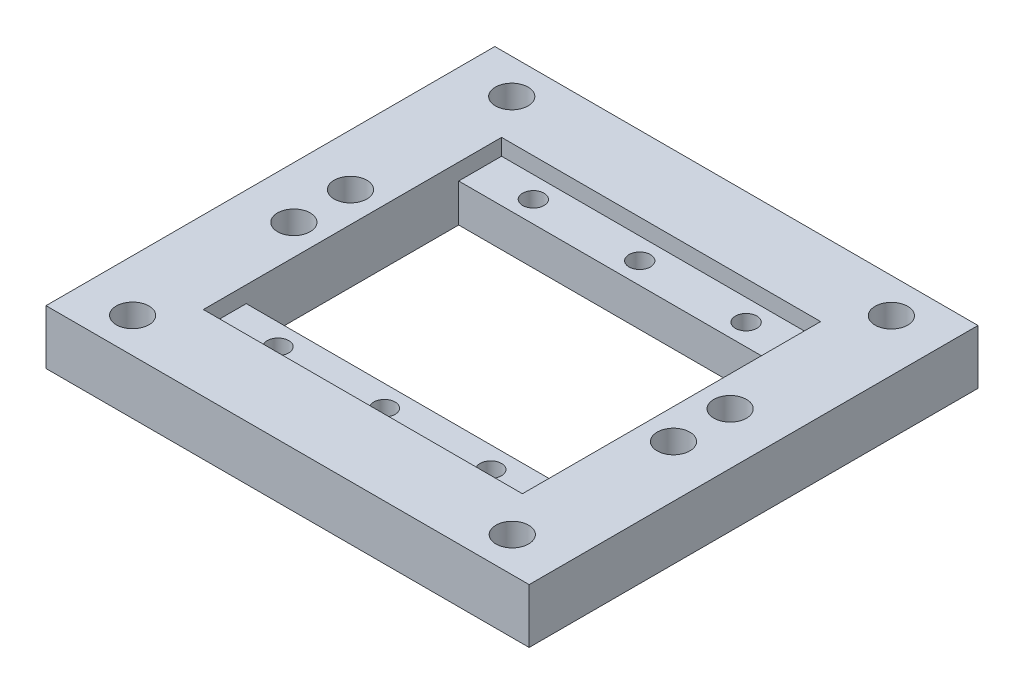
ISO-10303-21;
HEADER;
FILE_DESCRIPTION(('STEP AP214'),'2;1');
FILE_NAME('part.step','',(''),(''),'','','');
FILE_SCHEMA(('AUTOMOTIVE_DESIGN { 1 0 10303 214 1 1 1 1 }'));
ENDSEC;
DATA;
#1=APPLICATION_CONTEXT('core data for automotive mechanical design processes');
#2=APPLICATION_PROTOCOL_DEFINITION('international standard','automotive_design',2000,#1);
#3=PRODUCT_CONTEXT('',#1,'mechanical');
#4=PRODUCT('Part','Part','',(#3));
#5=PRODUCT_RELATED_PRODUCT_CATEGORY('part','',(#4));
#6=PRODUCT_DEFINITION_FORMATION('','',#4);
#7=PRODUCT_DEFINITION_CONTEXT('part definition',#1,'design');
#8=PRODUCT_DEFINITION('design','',#6,#7);
#9=PRODUCT_DEFINITION_SHAPE('','',#8);
#10=(LENGTH_UNIT() NAMED_UNIT(*) SI_UNIT(.MILLI.,.METRE.));
#11=(NAMED_UNIT(*) PLANE_ANGLE_UNIT() SI_UNIT($,.RADIAN.));
#12=(NAMED_UNIT(*) SI_UNIT($,.STERADIAN.) SOLID_ANGLE_UNIT());
#13=UNCERTAINTY_MEASURE_WITH_UNIT(LENGTH_MEASURE(1.E-05),#10,'distance_accuracy_value','');
#14=(GEOMETRIC_REPRESENTATION_CONTEXT(3) GLOBAL_UNCERTAINTY_ASSIGNED_CONTEXT((#13)) GLOBAL_UNIT_ASSIGNED_CONTEXT((#10,
#11,#12)) REPRESENTATION_CONTEXT('',''));
#15=CARTESIAN_POINT('',(0.,0.,0.));
#16=DIRECTION('',(0.,0.,1.));
#17=DIRECTION('',(1.,0.,0.));
#18=AXIS2_PLACEMENT_3D('',#15,#16,#17);
#19=CARTESIAN_POINT('',(93.519,12.7,0.));
#20=DIRECTION('',(1.,0.,0.));
#21=DIRECTION('',(0.,0.,-1.));
#22=AXIS2_PLACEMENT_3D('',#19,#20,#21);
#23=PLANE('',#22);
#24=DIRECTION('',(0.,0.,1.));
#25=VECTOR('',#24,1.);
#26=CARTESIAN_POINT('',(93.519,0.,0.));
#27=LINE('',#26,#25);
#28=CARTESIAN_POINT('',(93.519,0.,-77.089));
#29=VERTEX_POINT('',#28);
#30=CARTESIAN_POINT('',(93.519,0.,-27.559));
#31=VERTEX_POINT('',#30);
#32=EDGE_CURVE('E174',#29,#31,#27,.T.);
#33=ORIENTED_EDGE('',*,*,#32,.T.);
#34=DIRECTION('',(0.,-1.,0.));
#35=VECTOR('',#34,1.);
#36=CARTESIAN_POINT('',(93.519,8.89,-27.559));
#37=LINE('',#36,#35);
#38=CARTESIAN_POINT('',(93.519,8.89,-27.559));
#39=VERTEX_POINT('',#38);
#40=EDGE_CURVE('E266',#39,#31,#37,.T.);
#41=ORIENTED_EDGE('',*,*,#40,.F.);
#42=DIRECTION('',(0.,0.,1.));
#43=VECTOR('',#42,1.);
#44=CARTESIAN_POINT('',(93.519,8.89,0.));
#45=LINE('',#44,#43);
#46=CARTESIAN_POINT('',(93.519,8.89,-17.559));
#47=VERTEX_POINT('',#46);
#48=EDGE_CURVE('E127',#39,#47,#45,.T.);
#49=ORIENTED_EDGE('',*,*,#48,.T.);
#50=DIRECTION('',(0.,-1.,0.));
#51=VECTOR('',#50,1.);
#52=CARTESIAN_POINT('',(93.519,12.7,-17.559));
#53=LINE('',#52,#51);
#54=CARTESIAN_POINT('',(93.519,12.7,-17.559));
#55=VERTEX_POINT('',#54);
#56=EDGE_CURVE('E44',#55,#47,#53,.T.);
#57=ORIENTED_EDGE('',*,*,#56,.F.);
#58=DIRECTION('',(0.,0.,1.));
#59=VECTOR('',#58,1.);
#60=CARTESIAN_POINT('',(93.519,12.7,0.));
#61=LINE('',#60,#59);
#62=CARTESIAN_POINT('',(93.519,12.7,-87.089));
#63=VERTEX_POINT('',#62);
#64=EDGE_CURVE('E111',#63,#55,#61,.T.);
#65=ORIENTED_EDGE('',*,*,#64,.F.);
#66=DIRECTION('',(0.,-1.,0.));
#67=VECTOR('',#66,1.);
#68=CARTESIAN_POINT('',(93.519,12.7,-87.089));
#69=LINE('',#68,#67);
#70=CARTESIAN_POINT('',(93.519,8.89,-87.089));
#71=VERTEX_POINT('',#70);
#72=EDGE_CURVE('E11',#63,#71,#69,.T.);
#73=ORIENTED_EDGE('',*,*,#72,.T.);
#74=DIRECTION('',(0.,0.,1.));
#75=VECTOR('',#74,1.);
#76=CARTESIAN_POINT('',(93.519,8.89,0.));
#77=LINE('',#76,#75);
#78=CARTESIAN_POINT('',(93.519,8.89,-77.089));
#79=VERTEX_POINT('',#78);
#80=EDGE_CURVE('E244',#71,#79,#77,.T.);
#81=ORIENTED_EDGE('',*,*,#80,.T.);
#82=DIRECTION('',(0.,-1.,0.));
#83=VECTOR('',#82,1.);
#84=CARTESIAN_POINT('',(93.519,8.89,-77.089));
#85=LINE('',#84,#83);
#86=EDGE_CURVE('E246',#79,#29,#85,.T.);
#87=ORIENTED_EDGE('',*,*,#86,.T.);
#88=EDGE_LOOP('',(#33,#41,#49,#57,#65,#73,#81,#87));
#89=FACE_BOUND('',#88,.T.);
#90=ADVANCED_FACE('F35',(#89),#23,.F.);
#91=CARTESIAN_POINT('',(19.13,12.7,0.));
#92=DIRECTION('',(1.,0.,0.));
#93=DIRECTION('',(0.,0.,-1.));
#94=AXIS2_PLACEMENT_3D('',#91,#92,#93);
#95=PLANE('',#94);
#96=DIRECTION('',(0.,-1.,0.));
#97=VECTOR('',#96,1.);
#98=CARTESIAN_POINT('',(19.13,8.89,-27.559));
#99=LINE('',#98,#97);
#100=CARTESIAN_POINT('',(19.13,8.89,-27.559));
#101=VERTEX_POINT('',#100);
#102=CARTESIAN_POINT('',(19.13,0.,-27.559));
#103=VERTEX_POINT('',#102);
#104=EDGE_CURVE('E386',#101,#103,#99,.T.);
#105=ORIENTED_EDGE('',*,*,#104,.T.);
#106=DIRECTION('',(0.,0.,1.));
#107=VECTOR('',#106,1.);
#108=CARTESIAN_POINT('',(19.13,0.,0.));
#109=LINE('',#108,#107);
#110=CARTESIAN_POINT('',(19.13,0.,-77.089));
#111=VERTEX_POINT('',#110);
#112=EDGE_CURVE('E176',#111,#103,#109,.T.);
#113=ORIENTED_EDGE('',*,*,#112,.F.);
#114=DIRECTION('',(0.,-1.,0.));
#115=VECTOR('',#114,1.);
#116=CARTESIAN_POINT('',(19.13,8.89,-77.089));
#117=LINE('',#116,#115);
#118=CARTESIAN_POINT('',(19.13,8.89,-77.089));
#119=VERTEX_POINT('',#118);
#120=EDGE_CURVE('E52',#119,#111,#117,.T.);
#121=ORIENTED_EDGE('',*,*,#120,.F.);
#122=DIRECTION('',(0.,0.,1.));
#123=VECTOR('',#122,1.);
#124=CARTESIAN_POINT('',(19.13,8.89,0.));
#125=LINE('',#124,#123);
#126=CARTESIAN_POINT('',(19.13,8.89,-87.089));
#127=VERTEX_POINT('',#126);
#128=EDGE_CURVE('E245',#127,#119,#125,.T.);
#129=ORIENTED_EDGE('',*,*,#128,.F.);
#130=DIRECTION('',(0.,-1.,0.));
#131=VECTOR('',#130,1.);
#132=CARTESIAN_POINT('',(19.13,12.7,-87.089));
#133=LINE('',#132,#131);
#134=CARTESIAN_POINT('',(19.13,12.7,-87.089));
#135=VERTEX_POINT('',#134);
#136=EDGE_CURVE('E61',#135,#127,#133,.T.);
#137=ORIENTED_EDGE('',*,*,#136,.F.);
#138=DIRECTION('',(0.,0.,1.));
#139=VECTOR('',#138,1.);
#140=CARTESIAN_POINT('',(19.13,12.7,0.));
#141=LINE('',#140,#139);
#142=CARTESIAN_POINT('',(19.13,12.7,-17.559));
#143=VERTEX_POINT('',#142);
#144=EDGE_CURVE('E134',#135,#143,#141,.T.);
#145=ORIENTED_EDGE('',*,*,#144,.T.);
#146=DIRECTION('',(0.,-1.,0.));
#147=VECTOR('',#146,1.);
#148=CARTESIAN_POINT('',(19.13,12.7,-17.559));
#149=LINE('',#148,#147);
#150=CARTESIAN_POINT('',(19.13,8.89,-17.559));
#151=VERTEX_POINT('',#150);
#152=EDGE_CURVE('E130',#143,#151,#149,.T.);
#153=ORIENTED_EDGE('',*,*,#152,.T.);
#154=DIRECTION('',(0.,0.,1.));
#155=VECTOR('',#154,1.);
#156=CARTESIAN_POINT('',(19.13,8.89,0.));
#157=LINE('',#156,#155);
#158=EDGE_CURVE('E387',#101,#151,#157,.T.);
#159=ORIENTED_EDGE('',*,*,#158,.F.);
#160=EDGE_LOOP('',(#105,#113,#121,#129,#137,#145,#153,#159));
#161=FACE_BOUND('',#160,.T.);
#162=ADVANCED_FACE('F212',(#161),#95,.T.);
#163=CARTESIAN_POINT('',(0.,12.7,-87.089));
#164=DIRECTION('',(0.,0.,-1.));
#165=DIRECTION('',(-1.,0.,0.));
#166=AXIS2_PLACEMENT_3D('',#163,#164,#165);
#167=PLANE('',#166);
#168=ORIENTED_EDGE('',*,*,#136,.T.);
#169=DIRECTION('',(1.,0.,0.));
#170=VECTOR('',#169,1.);
#171=CARTESIAN_POINT('',(0.,8.89,-87.089));
#172=LINE('',#171,#170);
#173=EDGE_CURVE('E230',#127,#71,#172,.T.);
#174=ORIENTED_EDGE('',*,*,#173,.T.);
#175=ORIENTED_EDGE('',*,*,#72,.F.);
#176=DIRECTION('',(1.,0.,0.));
#177=VECTOR('',#176,1.);
#178=CARTESIAN_POINT('',(0.,12.7,-87.089));
#179=LINE('',#178,#177);
#180=EDGE_CURVE('E117',#135,#63,#179,.T.);
#181=ORIENTED_EDGE('',*,*,#180,.F.);
#182=EDGE_LOOP('',(#168,#174,#175,#181));
#183=FACE_BOUND('',#182,.T.);
#184=ADVANCED_FACE('F217',(#183),#167,.F.);
#185=CARTESIAN_POINT('',(0.,12.7,-17.559));
#186=DIRECTION('',(0.,0.,-1.));
#187=DIRECTION('',(-1.,0.,0.));
#188=AXIS2_PLACEMENT_3D('',#185,#186,#187);
#189=PLANE('',#188);
#190=DIRECTION('',(1.,0.,0.));
#191=VECTOR('',#190,1.);
#192=CARTESIAN_POINT('',(0.,8.89,-17.559));
#193=LINE('',#192,#191);
#194=EDGE_CURVE('E376',#151,#47,#193,.T.);
#195=ORIENTED_EDGE('',*,*,#194,.F.);
#196=ORIENTED_EDGE('',*,*,#152,.F.);
#197=DIRECTION('',(1.,0.,0.));
#198=VECTOR('',#197,1.);
#199=CARTESIAN_POINT('',(0.,12.7,-17.559));
#200=LINE('',#199,#198);
#201=EDGE_CURVE('E116',#143,#55,#200,.T.);
#202=ORIENTED_EDGE('',*,*,#201,.T.);
#203=ORIENTED_EDGE('',*,*,#56,.T.);
#204=EDGE_LOOP('',(#195,#196,#202,#203));
#205=FACE_BOUND('',#204,.T.);
#206=ADVANCED_FACE('F132',(#205),#189,.T.);
#207=CARTESIAN_POINT('',(0.,12.7,0.));
#208=DIRECTION('',(0.,0.,-1.));
#209=DIRECTION('',(-1.,0.,0.));
#210=AXIS2_PLACEMENT_3D('',#207,#208,#209);
#211=PLANE('',#210);
#212=DIRECTION('',(1.,0.,0.));
#213=VECTOR('',#212,1.);
#214=CARTESIAN_POINT('',(0.,0.,0.));
#215=LINE('',#214,#213);
#216=CARTESIAN_POINT('',(0.,0.,0.));
#217=VERTEX_POINT('',#216);
#218=CARTESIAN_POINT('',(112.649,0.,0.));
#219=VERTEX_POINT('',#218);
#220=EDGE_CURVE('E163',#217,#219,#215,.T.);
#221=ORIENTED_EDGE('',*,*,#220,.T.);
#222=DIRECTION('',(0.,-1.,0.));
#223=VECTOR('',#222,1.);
#224=CARTESIAN_POINT('',(112.649,12.7,0.));
#225=LINE('',#224,#223);
#226=CARTESIAN_POINT('',(112.649,12.7,0.));
#227=VERTEX_POINT('',#226);
#228=EDGE_CURVE('E39',#227,#219,#225,.T.);
#229=ORIENTED_EDGE('',*,*,#228,.F.);
#230=DIRECTION('',(1.,0.,0.));
#231=VECTOR('',#230,1.);
#232=CARTESIAN_POINT('',(0.,12.7,0.));
#233=LINE('',#232,#231);
#234=CARTESIAN_POINT('',(0.,12.7,0.));
#235=VERTEX_POINT('',#234);
#236=EDGE_CURVE('E298',#235,#227,#233,.T.);
#237=ORIENTED_EDGE('',*,*,#236,.F.);
#238=DIRECTION('',(0.,-1.,0.));
#239=VECTOR('',#238,1.);
#240=CARTESIAN_POINT('',(0.,12.7,0.));
#241=LINE('',#240,#239);
#242=EDGE_CURVE('E84',#235,#217,#241,.T.);
#243=ORIENTED_EDGE('',*,*,#242,.T.);
#244=EDGE_LOOP('',(#221,#229,#237,#243));
#245=FACE_BOUND('',#244,.T.);
#246=ADVANCED_FACE('F190',(#245),#211,.F.);
#247=CARTESIAN_POINT('',(112.649,12.7,0.));
#248=DIRECTION('',(-1.,0.,0.));
#249=DIRECTION('',(0.,0.,1.));
#250=AXIS2_PLACEMENT_3D('',#247,#248,#249);
#251=PLANE('',#250);
#252=DIRECTION('',(0.,0.,-1.));
#253=VECTOR('',#252,1.);
#254=CARTESIAN_POINT('',(112.649,0.,0.));
#255=LINE('',#254,#253);
#256=CARTESIAN_POINT('',(112.649,0.,-104.648));
#257=VERTEX_POINT('',#256);
#258=EDGE_CURVE('E165',#219,#257,#255,.T.);
#259=ORIENTED_EDGE('',*,*,#258,.T.);
#260=DIRECTION('',(0.,-1.,0.));
#261=VECTOR('',#260,1.);
#262=CARTESIAN_POINT('',(112.649,12.7,-104.648));
#263=LINE('',#262,#261);
#264=CARTESIAN_POINT('',(112.649,12.7,-104.648));
#265=VERTEX_POINT('',#264);
#266=EDGE_CURVE('E184',#265,#257,#263,.T.);
#267=ORIENTED_EDGE('',*,*,#266,.F.);
#268=DIRECTION('',(0.,0.,-1.));
#269=VECTOR('',#268,1.);
#270=CARTESIAN_POINT('',(112.649,12.7,0.));
#271=LINE('',#270,#269);
#272=EDGE_CURVE('E93',#227,#265,#271,.T.);
#273=ORIENTED_EDGE('',*,*,#272,.F.);
#274=ORIENTED_EDGE('',*,*,#228,.T.);
#275=EDGE_LOOP('',(#259,#267,#273,#274));
#276=FACE_BOUND('',#275,.T.);
#277=ADVANCED_FACE('F189',(#276),#251,.F.);
#278=CARTESIAN_POINT('',(0.,12.7,-104.648));
#279=DIRECTION('',(0.,0.,-1.));
#280=DIRECTION('',(-1.,0.,0.));
#281=AXIS2_PLACEMENT_3D('',#278,#279,#280);
#282=PLANE('',#281);
#283=DIRECTION('',(1.,0.,0.));
#284=VECTOR('',#283,1.);
#285=CARTESIAN_POINT('',(0.,0.,-104.648));
#286=LINE('',#285,#284);
#287=CARTESIAN_POINT('',(0.,0.,-104.648));
#288=VERTEX_POINT('',#287);
#289=EDGE_CURVE('E168',#288,#257,#286,.T.);
#290=ORIENTED_EDGE('',*,*,#289,.F.);
#291=DIRECTION('',(0.,-1.,0.));
#292=VECTOR('',#291,1.);
#293=CARTESIAN_POINT('',(0.,12.7,-104.648));
#294=LINE('',#293,#292);
#295=CARTESIAN_POINT('',(0.,12.7,-104.648));
#296=VERTEX_POINT('',#295);
#297=EDGE_CURVE('E183',#296,#288,#294,.T.);
#298=ORIENTED_EDGE('',*,*,#297,.F.);
#299=DIRECTION('',(1.,0.,0.));
#300=VECTOR('',#299,1.);
#301=CARTESIAN_POINT('',(0.,12.7,-104.648));
#302=LINE('',#301,#300);
#303=EDGE_CURVE('E301',#296,#265,#302,.T.);
#304=ORIENTED_EDGE('',*,*,#303,.T.);
#305=ORIENTED_EDGE('',*,*,#266,.T.);
#306=EDGE_LOOP('',(#290,#298,#304,#305));
#307=FACE_BOUND('',#306,.T.);
#308=ADVANCED_FACE('F201',(#307),#282,.T.);
#309=CARTESIAN_POINT('',(0.,12.7,0.));
#310=DIRECTION('',(-1.,0.,0.));
#311=DIRECTION('',(0.,0.,1.));
#312=AXIS2_PLACEMENT_3D('',#309,#310,#311);
#313=PLANE('',#312);
#314=DIRECTION('',(0.,0.,-1.));
#315=VECTOR('',#314,1.);
#316=CARTESIAN_POINT('',(0.,0.,0.));
#317=LINE('',#316,#315);
#318=EDGE_CURVE('E171',#217,#288,#317,.T.);
#319=ORIENTED_EDGE('',*,*,#318,.F.);
#320=ORIENTED_EDGE('',*,*,#242,.F.);
#321=DIRECTION('',(0.,0.,-1.));
#322=VECTOR('',#321,1.);
#323=CARTESIAN_POINT('',(0.,12.7,0.));
#324=LINE('',#323,#322);
#325=EDGE_CURVE('E199',#235,#296,#324,.T.);
#326=ORIENTED_EDGE('',*,*,#325,.T.);
#327=ORIENTED_EDGE('',*,*,#297,.T.);
#328=EDGE_LOOP('',(#319,#320,#326,#327));
#329=FACE_BOUND('',#328,.T.);
#330=ADVANCED_FACE('F196',(#329),#313,.T.);
#331=CARTESIAN_POINT('',(12.065,12.7,-96.52));
#332=DIRECTION('',(0.,-1.,0.));
#333=DIRECTION('',(0.,0.,-1.));
#334=AXIS2_PLACEMENT_3D('',#331,#332,#333);
#335=CYLINDRICAL_SURFACE('',#334,3.81);
#336=CARTESIAN_POINT('',(12.065,12.7,-96.52));
#337=DIRECTION('',(0.,1.,0.));
#338=DIRECTION('',(0.,0.,1.));
#339=AXIS2_PLACEMENT_3D('',#336,#337,#338);
#340=CIRCLE('',#339,3.81);
#341=CARTESIAN_POINT('',(12.065,12.7,-92.71));
#342=VERTEX_POINT('',#341);
#343=EDGE_CURVE('E295',#342,#342,#340,.T.);
#344=ORIENTED_EDGE('',*,*,#343,.T.);
#345=EDGE_LOOP('',(#344));
#346=FACE_BOUND('',#345,.T.);
#347=CARTESIAN_POINT('',(12.065,0.,-96.52));
#348=DIRECTION('',(0.,1.,0.));
#349=DIRECTION('',(0.,0.,1.));
#350=AXIS2_PLACEMENT_3D('',#347,#348,#349);
#351=CIRCLE('',#350,3.81);
#352=CARTESIAN_POINT('',(12.065,0.,-92.71));
#353=VERTEX_POINT('',#352);
#354=EDGE_CURVE('E160',#353,#353,#351,.T.);
#355=ORIENTED_EDGE('',*,*,#354,.F.);
#356=EDGE_LOOP('',(#355));
#357=FACE_BOUND('',#356,.T.);
#358=ADVANCED_FACE('F208',(#346,#357),#335,.F.);
#359=CARTESIAN_POINT('',(12.065,12.7,-58.928));
#360=DIRECTION('',(0.,-1.,0.));
#361=DIRECTION('',(0.,0.,-1.));
#362=AXIS2_PLACEMENT_3D('',#359,#360,#361);
#363=CYLINDRICAL_SURFACE('',#362,3.81);
#364=CARTESIAN_POINT('',(12.065,12.7,-58.928));
#365=DIRECTION('',(0.,1.,0.));
#366=DIRECTION('',(0.,0.,1.));
#367=AXIS2_PLACEMENT_3D('',#364,#365,#366);
#368=CIRCLE('',#367,3.81);
#369=CARTESIAN_POINT('',(12.065,12.7,-55.118));
#370=VERTEX_POINT('',#369);
#371=EDGE_CURVE('E292',#370,#370,#368,.T.);
#372=ORIENTED_EDGE('',*,*,#371,.T.);
#373=EDGE_LOOP('',(#372));
#374=FACE_BOUND('',#373,.T.);
#375=CARTESIAN_POINT('',(12.065,0.,-58.928));
#376=DIRECTION('',(0.,1.,0.));
#377=DIRECTION('',(0.,0.,1.));
#378=AXIS2_PLACEMENT_3D('',#375,#376,#377);
#379=CIRCLE('',#378,3.81);
#380=CARTESIAN_POINT('',(12.065,0.,-55.118));
#381=VERTEX_POINT('',#380);
#382=EDGE_CURVE('E157',#381,#381,#379,.T.);
#383=ORIENTED_EDGE('',*,*,#382,.F.);
#384=EDGE_LOOP('',(#383));
#385=FACE_BOUND('',#384,.T.);
#386=ADVANCED_FACE('F451',(#374,#385),#363,.F.);
#387=CARTESIAN_POINT('',(12.065,12.7,-45.72));
#388=DIRECTION('',(0.,-1.,0.));
#389=DIRECTION('',(0.,0.,-1.));
#390=AXIS2_PLACEMENT_3D('',#387,#388,#389);
#391=CYLINDRICAL_SURFACE('',#390,3.81);
#392=CARTESIAN_POINT('',(12.065,12.7,-45.72));
#393=DIRECTION('',(0.,1.,0.));
#394=DIRECTION('',(0.,0.,1.));
#395=AXIS2_PLACEMENT_3D('',#392,#393,#394);
#396=CIRCLE('',#395,3.81);
#397=CARTESIAN_POINT('',(12.065,12.7,-41.91));
#398=VERTEX_POINT('',#397);
#399=EDGE_CURVE('E289',#398,#398,#396,.T.);
#400=ORIENTED_EDGE('',*,*,#399,.T.);
#401=EDGE_LOOP('',(#400));
#402=FACE_BOUND('',#401,.T.);
#403=CARTESIAN_POINT('',(12.065,0.,-45.72));
#404=DIRECTION('',(0.,1.,0.));
#405=DIRECTION('',(0.,0.,1.));
#406=AXIS2_PLACEMENT_3D('',#403,#404,#405);
#407=CIRCLE('',#406,3.81);
#408=CARTESIAN_POINT('',(12.065,0.,-41.91));
#409=VERTEX_POINT('',#408);
#410=EDGE_CURVE('E154',#409,#409,#407,.T.);
#411=ORIENTED_EDGE('',*,*,#410,.F.);
#412=EDGE_LOOP('',(#411));
#413=FACE_BOUND('',#412,.T.);
#414=ADVANCED_FACE('F457',(#402,#413),#391,.F.);
#415=CARTESIAN_POINT('',(12.065,12.7,-8.128));
#416=DIRECTION('',(0.,-1.,0.));
#417=DIRECTION('',(0.,0.,-1.));
#418=AXIS2_PLACEMENT_3D('',#415,#416,#417);
#419=CYLINDRICAL_SURFACE('',#418,3.81);
#420=CARTESIAN_POINT('',(12.065,12.7,-8.128));
#421=DIRECTION('',(0.,1.,0.));
#422=DIRECTION('',(0.,0.,1.));
#423=AXIS2_PLACEMENT_3D('',#420,#421,#422);
#424=CIRCLE('',#423,3.81);
#425=CARTESIAN_POINT('',(12.065,12.7,-4.318));
#426=VERTEX_POINT('',#425);
#427=EDGE_CURVE('E286',#426,#426,#424,.T.);
#428=ORIENTED_EDGE('',*,*,#427,.T.);
#429=EDGE_LOOP('',(#428));
#430=FACE_BOUND('',#429,.T.);
#431=CARTESIAN_POINT('',(12.065,0.,-8.128));
#432=DIRECTION('',(0.,1.,0.));
#433=DIRECTION('',(0.,0.,1.));
#434=AXIS2_PLACEMENT_3D('',#431,#432,#433);
#435=CIRCLE('',#434,3.81);
#436=CARTESIAN_POINT('',(12.065,0.,-4.318));
#437=VERTEX_POINT('',#436);
#438=EDGE_CURVE('E151',#437,#437,#435,.T.);
#439=ORIENTED_EDGE('',*,*,#438,.F.);
#440=EDGE_LOOP('',(#439));
#441=FACE_BOUND('',#440,.T.);
#442=ADVANCED_FACE('F464',(#430,#441),#419,.F.);
#443=CARTESIAN_POINT('',(100.584,12.7,-8.128));
#444=DIRECTION('',(0.,-1.,0.));
#445=DIRECTION('',(0.,0.,-1.));
#446=AXIS2_PLACEMENT_3D('',#443,#444,#445);
#447=CYLINDRICAL_SURFACE('',#446,3.81);
#448=CARTESIAN_POINT('',(100.584,12.7,-8.128));
#449=DIRECTION('',(0.,1.,0.));
#450=DIRECTION('',(0.,0.,1.));
#451=AXIS2_PLACEMENT_3D('',#448,#449,#450);
#452=CIRCLE('',#451,3.81);
#453=CARTESIAN_POINT('',(100.584,12.7,-4.318));
#454=VERTEX_POINT('',#453);
#455=EDGE_CURVE('E283',#454,#454,#452,.T.);
#456=ORIENTED_EDGE('',*,*,#455,.T.);
#457=EDGE_LOOP('',(#456));
#458=FACE_BOUND('',#457,.T.);
#459=CARTESIAN_POINT('',(100.584,0.,-8.128));
#460=DIRECTION('',(0.,1.,0.));
#461=DIRECTION('',(0.,0.,1.));
#462=AXIS2_PLACEMENT_3D('',#459,#460,#461);
#463=CIRCLE('',#462,3.81);
#464=CARTESIAN_POINT('',(100.584,0.,-4.318));
#465=VERTEX_POINT('',#464);
#466=EDGE_CURVE('E148',#465,#465,#463,.T.);
#467=ORIENTED_EDGE('',*,*,#466,.F.);
#468=EDGE_LOOP('',(#467));
#469=FACE_BOUND('',#468,.T.);
#470=ADVANCED_FACE('F468',(#458,#469),#447,.F.);
#471=CARTESIAN_POINT('',(100.584,12.7,-45.72));
#472=DIRECTION('',(0.,-1.,0.));
#473=DIRECTION('',(0.,0.,-1.));
#474=AXIS2_PLACEMENT_3D('',#471,#472,#473);
#475=CYLINDRICAL_SURFACE('',#474,3.81);
#476=CARTESIAN_POINT('',(100.584,12.7,-45.72));
#477=DIRECTION('',(0.,1.,0.));
#478=DIRECTION('',(0.,0.,1.));
#479=AXIS2_PLACEMENT_3D('',#476,#477,#478);
#480=CIRCLE('',#479,3.81);
#481=CARTESIAN_POINT('',(100.584,12.7,-41.91));
#482=VERTEX_POINT('',#481);
#483=EDGE_CURVE('E280',#482,#482,#480,.T.);
#484=ORIENTED_EDGE('',*,*,#483,.T.);
#485=EDGE_LOOP('',(#484));
#486=FACE_BOUND('',#485,.T.);
#487=CARTESIAN_POINT('',(100.584,0.,-45.72));
#488=DIRECTION('',(0.,1.,0.));
#489=DIRECTION('',(0.,0.,1.));
#490=AXIS2_PLACEMENT_3D('',#487,#488,#489);
#491=CIRCLE('',#490,3.81);
#492=CARTESIAN_POINT('',(100.584,0.,-41.91));
#493=VERTEX_POINT('',#492);
#494=EDGE_CURVE('E145',#493,#493,#491,.T.);
#495=ORIENTED_EDGE('',*,*,#494,.F.);
#496=EDGE_LOOP('',(#495));
#497=FACE_BOUND('',#496,.T.);
#498=ADVANCED_FACE('F472',(#486,#497),#475,.F.);
#499=CARTESIAN_POINT('',(100.584,12.7,-58.928));
#500=DIRECTION('',(0.,-1.,0.));
#501=DIRECTION('',(0.,0.,-1.));
#502=AXIS2_PLACEMENT_3D('',#499,#500,#501);
#503=CYLINDRICAL_SURFACE('',#502,3.81);
#504=CARTESIAN_POINT('',(100.584,12.7,-58.928));
#505=DIRECTION('',(0.,1.,0.));
#506=DIRECTION('',(0.,0.,1.));
#507=AXIS2_PLACEMENT_3D('',#504,#505,#506);
#508=CIRCLE('',#507,3.81);
#509=CARTESIAN_POINT('',(100.584,12.7,-55.118));
#510=VERTEX_POINT('',#509);
#511=EDGE_CURVE('E277',#510,#510,#508,.T.);
#512=ORIENTED_EDGE('',*,*,#511,.T.);
#513=EDGE_LOOP('',(#512));
#514=FACE_BOUND('',#513,.T.);
#515=CARTESIAN_POINT('',(100.584,0.,-58.928));
#516=DIRECTION('',(0.,1.,0.));
#517=DIRECTION('',(0.,0.,1.));
#518=AXIS2_PLACEMENT_3D('',#515,#516,#517);
#519=CIRCLE('',#518,3.81);
#520=CARTESIAN_POINT('',(100.584,0.,-55.118));
#521=VERTEX_POINT('',#520);
#522=EDGE_CURVE('E142',#521,#521,#519,.T.);
#523=ORIENTED_EDGE('',*,*,#522,.F.);
#524=EDGE_LOOP('',(#523));
#525=FACE_BOUND('',#524,.T.);
#526=ADVANCED_FACE('F314',(#514,#525),#503,.F.);
#527=CARTESIAN_POINT('',(100.584,12.7,-96.52));
#528=DIRECTION('',(0.,-1.,0.));
#529=DIRECTION('',(0.,0.,-1.));
#530=AXIS2_PLACEMENT_3D('',#527,#528,#529);
#531=CYLINDRICAL_SURFACE('',#530,3.81);
#532=CARTESIAN_POINT('',(100.584,12.7,-96.52));
#533=DIRECTION('',(0.,1.,0.));
#534=DIRECTION('',(0.,0.,1.));
#535=AXIS2_PLACEMENT_3D('',#532,#533,#534);
#536=CIRCLE('',#535,3.81);
#537=CARTESIAN_POINT('',(100.584,12.7,-92.71));
#538=VERTEX_POINT('',#537);
#539=EDGE_CURVE('E179',#538,#538,#536,.T.);
#540=ORIENTED_EDGE('',*,*,#539,.T.);
#541=EDGE_LOOP('',(#540));
#542=FACE_BOUND('',#541,.T.);
#543=CARTESIAN_POINT('',(100.584,0.,-96.52));
#544=DIRECTION('',(0.,1.,0.));
#545=DIRECTION('',(0.,0.,1.));
#546=AXIS2_PLACEMENT_3D('',#543,#544,#545);
#547=CIRCLE('',#546,3.81);
#548=CARTESIAN_POINT('',(100.584,0.,-92.71));
#549=VERTEX_POINT('',#548);
#550=EDGE_CURVE('E139',#549,#549,#547,.T.);
#551=ORIENTED_EDGE('',*,*,#550,.F.);
#552=EDGE_LOOP('',(#551));
#553=FACE_BOUND('',#552,.T.);
#554=ADVANCED_FACE('F37',(#542,#553),#531,.F.);
#555=CARTESIAN_POINT('',(0.,12.7,0.));
#556=DIRECTION('',(0.,1.,0.));
#557=DIRECTION('',(0.,0.,1.));
#558=AXIS2_PLACEMENT_3D('',#555,#556,#557);
#559=PLANE('',#558);
#560=ORIENTED_EDGE('',*,*,#539,.F.);
#561=EDGE_LOOP('',(#560));
#562=FACE_BOUND('',#561,.T.);
#563=ORIENTED_EDGE('',*,*,#511,.F.);
#564=EDGE_LOOP('',(#563));
#565=FACE_BOUND('',#564,.T.);
#566=ORIENTED_EDGE('',*,*,#483,.F.);
#567=EDGE_LOOP('',(#566));
#568=FACE_BOUND('',#567,.T.);
#569=ORIENTED_EDGE('',*,*,#455,.F.);
#570=EDGE_LOOP('',(#569));
#571=FACE_BOUND('',#570,.T.);
#572=ORIENTED_EDGE('',*,*,#427,.F.);
#573=EDGE_LOOP('',(#572));
#574=FACE_BOUND('',#573,.T.);
#575=ORIENTED_EDGE('',*,*,#399,.F.);
#576=EDGE_LOOP('',(#575));
#577=FACE_BOUND('',#576,.T.);
#578=ORIENTED_EDGE('',*,*,#371,.F.);
#579=EDGE_LOOP('',(#578));
#580=FACE_BOUND('',#579,.T.);
#581=ORIENTED_EDGE('',*,*,#343,.F.);
#582=EDGE_LOOP('',(#581));
#583=FACE_BOUND('',#582,.T.);
#584=ORIENTED_EDGE('',*,*,#236,.T.);
#585=ORIENTED_EDGE('',*,*,#272,.T.);
#586=ORIENTED_EDGE('',*,*,#303,.F.);
#587=ORIENTED_EDGE('',*,*,#325,.F.);
#588=EDGE_LOOP('',(#584,#585,#586,#587));
#589=FACE_BOUND('',#588,.T.);
#590=ORIENTED_EDGE('',*,*,#180,.T.);
#591=ORIENTED_EDGE('',*,*,#64,.T.);
#592=ORIENTED_EDGE('',*,*,#201,.F.);
#593=ORIENTED_EDGE('',*,*,#144,.F.);
#594=EDGE_LOOP('',(#590,#591,#592,#593));
#595=FACE_BOUND('',#594,.T.);
#596=ADVANCED_FACE('F113',(#562,#565,#568,#571,#574,#577,#580,#583,#589,#595),#559,.T.);
#597=CARTESIAN_POINT('',(0.,0.,0.));
#598=DIRECTION('',(0.,1.,0.));
#599=DIRECTION('',(0.,0.,1.));
#600=AXIS2_PLACEMENT_3D('',#597,#598,#599);
#601=PLANE('',#600);
#602=ORIENTED_EDGE('',*,*,#32,.F.);
#603=DIRECTION('',(1.,0.,0.));
#604=VECTOR('',#603,1.);
#605=CARTESIAN_POINT('',(0.,0.,-77.089));
#606=LINE('',#605,#604);
#607=EDGE_CURVE('E250',#111,#29,#606,.T.);
#608=ORIENTED_EDGE('',*,*,#607,.F.);
#609=ORIENTED_EDGE('',*,*,#112,.T.);
#610=DIRECTION('',(1.,0.,0.));
#611=VECTOR('',#610,1.);
#612=CARTESIAN_POINT('',(0.,0.,-27.559));
#613=LINE('',#612,#611);
#614=EDGE_CURVE('E416',#103,#31,#613,.T.);
#615=ORIENTED_EDGE('',*,*,#614,.T.);
#616=EDGE_LOOP('',(#602,#608,#609,#615));
#617=FACE_BOUND('',#616,.T.);
#618=ORIENTED_EDGE('',*,*,#550,.T.);
#619=EDGE_LOOP('',(#618));
#620=FACE_BOUND('',#619,.T.);
#621=ORIENTED_EDGE('',*,*,#522,.T.);
#622=EDGE_LOOP('',(#621));
#623=FACE_BOUND('',#622,.T.);
#624=ORIENTED_EDGE('',*,*,#494,.T.);
#625=EDGE_LOOP('',(#624));
#626=FACE_BOUND('',#625,.T.);
#627=ORIENTED_EDGE('',*,*,#466,.T.);
#628=EDGE_LOOP('',(#627));
#629=FACE_BOUND('',#628,.T.);
#630=ORIENTED_EDGE('',*,*,#438,.T.);
#631=EDGE_LOOP('',(#630));
#632=FACE_BOUND('',#631,.T.);
#633=ORIENTED_EDGE('',*,*,#410,.T.);
#634=EDGE_LOOP('',(#633));
#635=FACE_BOUND('',#634,.T.);
#636=ORIENTED_EDGE('',*,*,#382,.T.);
#637=EDGE_LOOP('',(#636));
#638=FACE_BOUND('',#637,.T.);
#639=ORIENTED_EDGE('',*,*,#354,.T.);
#640=EDGE_LOOP('',(#639));
#641=FACE_BOUND('',#640,.T.);
#642=ORIENTED_EDGE('',*,*,#220,.F.);
#643=ORIENTED_EDGE('',*,*,#318,.T.);
#644=ORIENTED_EDGE('',*,*,#289,.T.);
#645=ORIENTED_EDGE('',*,*,#258,.F.);
#646=EDGE_LOOP('',(#642,#643,#644,#645));
#647=FACE_BOUND('',#646,.T.);
#648=CARTESIAN_POINT('',(81.1483333333333,0.,-82.089));
#649=DIRECTION('',(0.,1.,0.));
#650=DIRECTION('',(0.,0.,1.));
#651=AXIS2_PLACEMENT_3D('',#648,#649,#650);
#652=CIRCLE('',#651,2.50000000000001);
#653=CARTESIAN_POINT('',(81.1483333333333,0.,-79.589));
#654=VERTEX_POINT('',#653);
#655=EDGE_CURVE('E262',#654,#654,#652,.T.);
#656=ORIENTED_EDGE('',*,*,#655,.T.);
#657=EDGE_LOOP('',(#656));
#658=FACE_BOUND('',#657,.T.);
#659=CARTESIAN_POINT('',(56.341,0.,-82.089));
#660=DIRECTION('',(0.,1.,0.));
#661=DIRECTION('',(0.,0.,1.));
#662=AXIS2_PLACEMENT_3D('',#659,#660,#661);
#663=CIRCLE('',#662,2.5);
#664=CARTESIAN_POINT('',(56.341,0.,-79.589));
#665=VERTEX_POINT('',#664);
#666=EDGE_CURVE('E265',#665,#665,#663,.T.);
#667=ORIENTED_EDGE('',*,*,#666,.T.);
#668=EDGE_LOOP('',(#667));
#669=FACE_BOUND('',#668,.T.);
#670=CARTESIAN_POINT('',(31.5336666666667,0.,-82.089));
#671=DIRECTION('',(0.,1.,0.));
#672=DIRECTION('',(0.,0.,1.));
#673=AXIS2_PLACEMENT_3D('',#670,#671,#672);
#674=CIRCLE('',#673,2.5);
#675=CARTESIAN_POINT('',(31.5336666666667,0.,-79.589));
#676=VERTEX_POINT('',#675);
#677=EDGE_CURVE('E269',#676,#676,#674,.T.);
#678=ORIENTED_EDGE('',*,*,#677,.T.);
#679=EDGE_LOOP('',(#678));
#680=FACE_BOUND('',#679,.T.);
#681=CARTESIAN_POINT('',(31.5336666666667,0.,-22.559));
#682=DIRECTION('',(0.,1.,0.));
#683=DIRECTION('',(0.,0.,1.));
#684=AXIS2_PLACEMENT_3D('',#681,#682,#683);
#685=CIRCLE('',#684,2.49999999999999);
#686=CARTESIAN_POINT('',(31.5336666666667,0.,-20.059));
#687=VERTEX_POINT('',#686);
#688=EDGE_CURVE('E407',#687,#687,#685,.T.);
#689=ORIENTED_EDGE('',*,*,#688,.T.);
#690=EDGE_LOOP('',(#689));
#691=FACE_BOUND('',#690,.T.);
#692=CARTESIAN_POINT('',(56.341,0.,-22.559));
#693=DIRECTION('',(0.,1.,0.));
#694=DIRECTION('',(0.,0.,1.));
#695=AXIS2_PLACEMENT_3D('',#692,#693,#694);
#696=CIRCLE('',#695,2.5);
#697=CARTESIAN_POINT('',(56.341,0.,-20.059));
#698=VERTEX_POINT('',#697);
#699=EDGE_CURVE('E411',#698,#698,#696,.T.);
#700=ORIENTED_EDGE('',*,*,#699,.T.);
#701=EDGE_LOOP('',(#700));
#702=FACE_BOUND('',#701,.T.);
#703=CARTESIAN_POINT('',(81.1483333333333,0.,-22.559));
#704=DIRECTION('',(0.,1.,0.));
#705=DIRECTION('',(0.,0.,1.));
#706=AXIS2_PLACEMENT_3D('',#703,#704,#705);
#707=CIRCLE('',#706,2.50000000000001);
#708=CARTESIAN_POINT('',(81.1483333333333,0.,-20.059));
#709=VERTEX_POINT('',#708);
#710=EDGE_CURVE('E414',#709,#709,#707,.T.);
#711=ORIENTED_EDGE('',*,*,#710,.T.);
#712=EDGE_LOOP('',(#711));
#713=FACE_BOUND('',#712,.T.);
#714=ADVANCED_FACE('F193',(#617,#620,#623,#626,#629,#632,#635,#638,#641,#647,#658,#669,#680,
#691,#702,#713),#601,.F.);
#715=CARTESIAN_POINT('',(31.5336666666667,8.89,-82.089));
#716=DIRECTION('',(0.,-1.,0.));
#717=DIRECTION('',(0.,0.,-1.));
#718=AXIS2_PLACEMENT_3D('',#715,#716,#717);
#719=CYLINDRICAL_SURFACE('',#718,2.5);
#720=CARTESIAN_POINT('',(31.5336666666667,8.89,-82.089));
#721=DIRECTION('',(0.,1.,0.));
#722=DIRECTION('',(0.,0.,1.));
#723=AXIS2_PLACEMENT_3D('',#720,#721,#722);
#724=CIRCLE('',#723,2.5);
#725=CARTESIAN_POINT('',(31.5336666666667,8.89,-79.589));
#726=VERTEX_POINT('',#725);
#727=EDGE_CURVE('E253',#726,#726,#724,.T.);
#728=ORIENTED_EDGE('',*,*,#727,.T.);
#729=EDGE_LOOP('',(#728));
#730=FACE_BOUND('',#729,.T.);
#731=ORIENTED_EDGE('',*,*,#677,.F.);
#732=EDGE_LOOP('',(#731));
#733=FACE_BOUND('',#732,.T.);
#734=ADVANCED_FACE('F311',(#730,#733),#719,.F.);
#735=CARTESIAN_POINT('',(56.341,8.89,-82.089));
#736=DIRECTION('',(0.,-1.,0.));
#737=DIRECTION('',(0.,0.,-1.));
#738=AXIS2_PLACEMENT_3D('',#735,#736,#737);
#739=CYLINDRICAL_SURFACE('',#738,2.5);
#740=CARTESIAN_POINT('',(56.341,8.89,-82.089));
#741=DIRECTION('',(0.,1.,0.));
#742=DIRECTION('',(0.,0.,1.));
#743=AXIS2_PLACEMENT_3D('',#740,#741,#742);
#744=CIRCLE('',#743,2.5);
#745=CARTESIAN_POINT('',(56.341,8.89,-79.589));
#746=VERTEX_POINT('',#745);
#747=EDGE_CURVE('E257',#746,#746,#744,.T.);
#748=ORIENTED_EDGE('',*,*,#747,.T.);
#749=EDGE_LOOP('',(#748));
#750=FACE_BOUND('',#749,.T.);
#751=ORIENTED_EDGE('',*,*,#666,.F.);
#752=EDGE_LOOP('',(#751));
#753=FACE_BOUND('',#752,.T.);
#754=ADVANCED_FACE('F322',(#750,#753),#739,.F.);
#755=CARTESIAN_POINT('',(81.1483333333333,8.89,-82.089));
#756=DIRECTION('',(0.,-1.,0.));
#757=DIRECTION('',(0.,0.,-1.));
#758=AXIS2_PLACEMENT_3D('',#755,#756,#757);
#759=CYLINDRICAL_SURFACE('',#758,2.50000000000001);
#760=CARTESIAN_POINT('',(81.1483333333333,8.89,-82.089));
#761=DIRECTION('',(0.,1.,0.));
#762=DIRECTION('',(0.,0.,1.));
#763=AXIS2_PLACEMENT_3D('',#760,#761,#762);
#764=CIRCLE('',#763,2.50000000000001);
#765=CARTESIAN_POINT('',(81.1483333333333,8.89,-79.589));
#766=VERTEX_POINT('',#765);
#767=EDGE_CURVE('E272',#766,#766,#764,.T.);
#768=ORIENTED_EDGE('',*,*,#767,.T.);
#769=EDGE_LOOP('',(#768));
#770=FACE_BOUND('',#769,.T.);
#771=ORIENTED_EDGE('',*,*,#655,.F.);
#772=EDGE_LOOP('',(#771));
#773=FACE_BOUND('',#772,.T.);
#774=ADVANCED_FACE('F319',(#770,#773),#759,.F.);
#775=CARTESIAN_POINT('',(0.,8.89,-77.089));
#776=DIRECTION('',(0.,0.,-1.));
#777=DIRECTION('',(-1.,0.,0.));
#778=AXIS2_PLACEMENT_3D('',#775,#776,#777);
#779=PLANE('',#778);
#780=ORIENTED_EDGE('',*,*,#607,.T.);
#781=ORIENTED_EDGE('',*,*,#86,.F.);
#782=DIRECTION('',(1.,0.,0.));
#783=VECTOR('',#782,1.);
#784=CARTESIAN_POINT('',(0.,8.89,-77.089));
#785=LINE('',#784,#783);
#786=EDGE_CURVE('E240',#119,#79,#785,.T.);
#787=ORIENTED_EDGE('',*,*,#786,.F.);
#788=ORIENTED_EDGE('',*,*,#120,.T.);
#789=EDGE_LOOP('',(#780,#781,#787,#788));
#790=FACE_BOUND('',#789,.T.);
#791=ADVANCED_FACE('F249',(#790),#779,.F.);
#792=CARTESIAN_POINT('',(0.,8.89,0.));
#793=DIRECTION('',(0.,1.,0.));
#794=DIRECTION('',(0.,0.,1.));
#795=AXIS2_PLACEMENT_3D('',#792,#793,#794);
#796=PLANE('',#795);
#797=ORIENTED_EDGE('',*,*,#767,.F.);
#798=EDGE_LOOP('',(#797));
#799=FACE_BOUND('',#798,.T.);
#800=ORIENTED_EDGE('',*,*,#747,.F.);
#801=EDGE_LOOP('',(#800));
#802=FACE_BOUND('',#801,.T.);
#803=ORIENTED_EDGE('',*,*,#727,.F.);
#804=EDGE_LOOP('',(#803));
#805=FACE_BOUND('',#804,.T.);
#806=ORIENTED_EDGE('',*,*,#80,.F.);
#807=ORIENTED_EDGE('',*,*,#173,.F.);
#808=ORIENTED_EDGE('',*,*,#128,.T.);
#809=ORIENTED_EDGE('',*,*,#786,.T.);
#810=EDGE_LOOP('',(#806,#807,#808,#809));
#811=FACE_BOUND('',#810,.T.);
#812=ADVANCED_FACE('F242',(#799,#802,#805,#811),#796,.T.);
#813=CARTESIAN_POINT('',(0.,8.89,-27.559));
#814=DIRECTION('',(0.,0.,-1.));
#815=DIRECTION('',(-1.,0.,0.));
#816=AXIS2_PLACEMENT_3D('',#813,#814,#815);
#817=PLANE('',#816);
#818=ORIENTED_EDGE('',*,*,#614,.F.);
#819=ORIENTED_EDGE('',*,*,#104,.F.);
#820=DIRECTION('',(1.,0.,0.));
#821=VECTOR('',#820,1.);
#822=CARTESIAN_POINT('',(0.,8.89,-27.559));
#823=LINE('',#822,#821);
#824=EDGE_CURVE('E374',#101,#39,#823,.T.);
#825=ORIENTED_EDGE('',*,*,#824,.T.);
#826=ORIENTED_EDGE('',*,*,#40,.T.);
#827=EDGE_LOOP('',(#818,#819,#825,#826));
#828=FACE_BOUND('',#827,.T.);
#829=ADVANCED_FACE('F334',(#828),#817,.T.);
#830=CARTESIAN_POINT('',(81.1483333333333,8.89,-22.559));
#831=DIRECTION('',(0.,-1.,0.));
#832=DIRECTION('',(0.,0.,-1.));
#833=AXIS2_PLACEMENT_3D('',#830,#831,#832);
#834=CYLINDRICAL_SURFACE('',#833,2.50000000000001);
#835=CARTESIAN_POINT('',(81.1483333333333,8.89,-22.559));
#836=DIRECTION('',(0.,1.,0.));
#837=DIRECTION('',(0.,0.,1.));
#838=AXIS2_PLACEMENT_3D('',#835,#836,#837);
#839=CIRCLE('',#838,2.50000000000001);
#840=CARTESIAN_POINT('',(81.1483333333333,8.89,-20.059));
#841=VERTEX_POINT('',#840);
#842=EDGE_CURVE('E367',#841,#841,#839,.T.);
#843=ORIENTED_EDGE('',*,*,#842,.T.);
#844=EDGE_LOOP('',(#843));
#845=FACE_BOUND('',#844,.T.);
#846=ORIENTED_EDGE('',*,*,#710,.F.);
#847=EDGE_LOOP('',(#846));
#848=FACE_BOUND('',#847,.T.);
#849=ADVANCED_FACE('F344',(#845,#848),#834,.F.);
#850=CARTESIAN_POINT('',(56.341,8.89,-22.559));
#851=DIRECTION('',(0.,-1.,0.));
#852=DIRECTION('',(0.,0.,-1.));
#853=AXIS2_PLACEMENT_3D('',#850,#851,#852);
#854=CYLINDRICAL_SURFACE('',#853,2.5);
#855=CARTESIAN_POINT('',(56.341,8.89,-22.559));
#856=DIRECTION('',(0.,1.,0.));
#857=DIRECTION('',(0.,0.,1.));
#858=AXIS2_PLACEMENT_3D('',#855,#856,#857);
#859=CIRCLE('',#858,2.5);
#860=CARTESIAN_POINT('',(56.341,8.89,-20.059));
#861=VERTEX_POINT('',#860);
#862=EDGE_CURVE('E363',#861,#861,#859,.T.);
#863=ORIENTED_EDGE('',*,*,#862,.T.);
#864=EDGE_LOOP('',(#863));
#865=FACE_BOUND('',#864,.T.);
#866=ORIENTED_EDGE('',*,*,#699,.F.);
#867=EDGE_LOOP('',(#866));
#868=FACE_BOUND('',#867,.T.);
#869=ADVANCED_FACE('F340',(#865,#868),#854,.F.);
#870=CARTESIAN_POINT('',(31.5336666666667,8.89,-22.559));
#871=DIRECTION('',(0.,-1.,0.));
#872=DIRECTION('',(0.,0.,-1.));
#873=AXIS2_PLACEMENT_3D('',#870,#871,#872);
#874=CYLINDRICAL_SURFACE('',#873,2.49999999999999);
#875=CARTESIAN_POINT('',(31.5336666666667,8.89,-22.559));
#876=DIRECTION('',(0.,1.,0.));
#877=DIRECTION('',(0.,0.,1.));
#878=AXIS2_PLACEMENT_3D('',#875,#876,#877);
#879=CIRCLE('',#878,2.49999999999999);
#880=CARTESIAN_POINT('',(31.5336666666667,8.89,-20.059));
#881=VERTEX_POINT('',#880);
#882=EDGE_CURVE('E359',#881,#881,#879,.T.);
#883=ORIENTED_EDGE('',*,*,#882,.T.);
#884=EDGE_LOOP('',(#883));
#885=FACE_BOUND('',#884,.T.);
#886=ORIENTED_EDGE('',*,*,#688,.F.);
#887=EDGE_LOOP('',(#886));
#888=FACE_BOUND('',#887,.T.);
#889=ADVANCED_FACE('F336',(#885,#888),#874,.F.);
#890=CARTESIAN_POINT('',(0.,8.89,0.));
#891=DIRECTION('',(0.,1.,0.));
#892=DIRECTION('',(0.,0.,1.));
#893=AXIS2_PLACEMENT_3D('',#890,#891,#892);
#894=PLANE('',#893);
#895=ORIENTED_EDGE('',*,*,#882,.F.);
#896=EDGE_LOOP('',(#895));
#897=FACE_BOUND('',#896,.T.);
#898=ORIENTED_EDGE('',*,*,#862,.F.);
#899=EDGE_LOOP('',(#898));
#900=FACE_BOUND('',#899,.T.);
#901=ORIENTED_EDGE('',*,*,#842,.F.);
#902=EDGE_LOOP('',(#901));
#903=FACE_BOUND('',#902,.T.);
#904=ORIENTED_EDGE('',*,*,#48,.F.);
#905=ORIENTED_EDGE('',*,*,#824,.F.);
#906=ORIENTED_EDGE('',*,*,#158,.T.);
#907=ORIENTED_EDGE('',*,*,#194,.T.);
#908=EDGE_LOOP('',(#904,#905,#906,#907));
#909=FACE_BOUND('',#908,.T.);
#910=ADVANCED_FACE('F339',(#897,#900,#903,#909),#894,.T.);
#911=CLOSED_SHELL('',(#90,#162,#184,#206,#246,#277,#308,#330,#358,#386,#414,#442,#470,#498,#526,
#554,#596,#714,#734,#754,#774,#791,#812,#829,#849,#869,#889,#910));
#912=MANIFOLD_SOLID_BREP('B2',#911);
#913=ADVANCED_BREP_SHAPE_REPRESENTATION('',(#18,#912),#14);
#914=SHAPE_DEFINITION_REPRESENTATION(#9,#913);
ENDSEC;
END-ISO-10303-21;
